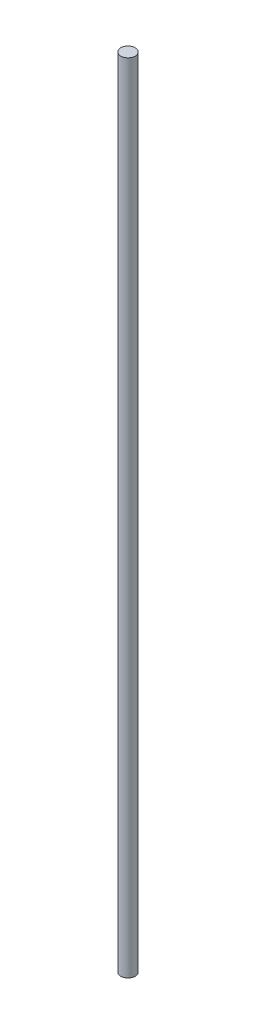
ISO-10303-21;
HEADER;
FILE_DESCRIPTION(('STEP AP214'),'2;1');
FILE_NAME('part.step','',(''),(''),'','','');
FILE_SCHEMA(('AUTOMOTIVE_DESIGN { 1 0 10303 214 1 1 1 1 }'));
ENDSEC;
DATA;
#1=APPLICATION_CONTEXT('core data for automotive mechanical design processes');
#2=APPLICATION_PROTOCOL_DEFINITION('international standard','automotive_design',2000,#1);
#3=PRODUCT_CONTEXT('',#1,'mechanical');
#4=PRODUCT('Part','Part','',(#3));
#5=PRODUCT_RELATED_PRODUCT_CATEGORY('part','',(#4));
#6=PRODUCT_DEFINITION_FORMATION('','',#4);
#7=PRODUCT_DEFINITION_CONTEXT('part definition',#1,'design');
#8=PRODUCT_DEFINITION('design','',#6,#7);
#9=PRODUCT_DEFINITION_SHAPE('','',#8);
#10=(LENGTH_UNIT() NAMED_UNIT(*) SI_UNIT(.MILLI.,.METRE.));
#11=(NAMED_UNIT(*) PLANE_ANGLE_UNIT() SI_UNIT($,.RADIAN.));
#12=(NAMED_UNIT(*) SI_UNIT($,.STERADIAN.) SOLID_ANGLE_UNIT());
#13=UNCERTAINTY_MEASURE_WITH_UNIT(LENGTH_MEASURE(1.E-05),#10,'distance_accuracy_value','');
#14=(GEOMETRIC_REPRESENTATION_CONTEXT(3) GLOBAL_UNCERTAINTY_ASSIGNED_CONTEXT((#13)) GLOBAL_UNIT_ASSIGNED_CONTEXT((#10,
#11,#12)) REPRESENTATION_CONTEXT('',''));
#15=CARTESIAN_POINT('',(0.,0.,0.));
#16=DIRECTION('',(0.,0.,1.));
#17=DIRECTION('',(1.,0.,0.));
#18=AXIS2_PLACEMENT_3D('',#15,#16,#17);
#19=CARTESIAN_POINT('',(0.,660.,0.));
#20=DIRECTION('',(0.,-1.,0.));
#21=DIRECTION('',(0.,0.,-1.));
#22=AXIS2_PLACEMENT_3D('',#19,#20,#21);
#23=CYLINDRICAL_SURFACE('',#22,6.);
#24=CARTESIAN_POINT('',(0.,660.,0.));
#25=DIRECTION('',(0.,1.,0.));
#26=DIRECTION('',(0.,0.,1.));
#27=AXIS2_PLACEMENT_3D('',#24,#25,#26);
#28=CIRCLE('',#27,6.);
#29=CARTESIAN_POINT('',(0.,660.,6.));
#30=VERTEX_POINT('',#29);
#31=EDGE_CURVE('E10',#30,#30,#28,.T.);
#32=ORIENTED_EDGE('',*,*,#31,.F.);
#33=EDGE_LOOP('',(#32));
#34=FACE_BOUND('',#33,.T.);
#35=CARTESIAN_POINT('',(0.,0.,0.));
#36=DIRECTION('',(0.,1.,0.));
#37=DIRECTION('',(0.,0.,1.));
#38=AXIS2_PLACEMENT_3D('',#35,#36,#37);
#39=CIRCLE('',#38,6.);
#40=CARTESIAN_POINT('',(0.,0.,6.));
#41=VERTEX_POINT('',#40);
#42=EDGE_CURVE('E40',#41,#41,#39,.T.);
#43=ORIENTED_EDGE('',*,*,#42,.T.);
#44=EDGE_LOOP('',(#43));
#45=FACE_BOUND('',#44,.T.);
#46=ADVANCED_FACE('F37',(#34,#45),#23,.T.);
#47=CARTESIAN_POINT('',(0.,660.,0.));
#48=DIRECTION('',(0.,1.,0.));
#49=DIRECTION('',(0.,0.,1.));
#50=AXIS2_PLACEMENT_3D('',#47,#48,#49);
#51=PLANE('',#50);
#52=ORIENTED_EDGE('',*,*,#31,.T.);
#53=EDGE_LOOP('',(#52));
#54=FACE_BOUND('',#53,.T.);
#55=ADVANCED_FACE('F54',(#54),#51,.T.);
#56=CARTESIAN_POINT('',(0.,0.,0.));
#57=DIRECTION('',(0.,1.,0.));
#58=DIRECTION('',(0.,0.,1.));
#59=AXIS2_PLACEMENT_3D('',#56,#57,#58);
#60=PLANE('',#59);
#61=ORIENTED_EDGE('',*,*,#42,.F.);
#62=EDGE_LOOP('',(#61));
#63=FACE_BOUND('',#62,.T.);
#64=ADVANCED_FACE('F52',(#63),#60,.F.);
#65=CLOSED_SHELL('',(#46,#55,#64));
#66=MANIFOLD_SOLID_BREP('B2',#65);
#67=ADVANCED_BREP_SHAPE_REPRESENTATION('',(#18,#66),#14);
#68=SHAPE_DEFINITION_REPRESENTATION(#9,#67);
ENDSEC;
END-ISO-10303-21;
